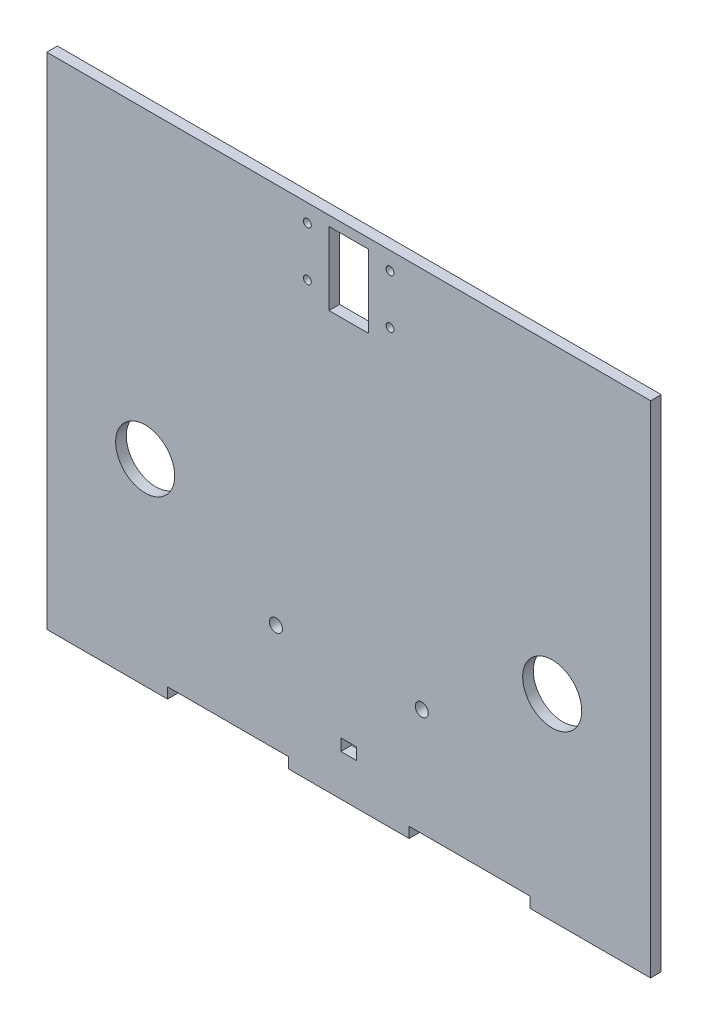
ISO-10303-21;
HEADER;
FILE_DESCRIPTION(('STEP AP214'),'2;1');
FILE_NAME('part.step','',(''),(''),'','','');
FILE_SCHEMA(('AUTOMOTIVE_DESIGN { 1 0 10303 214 1 1 1 1 }'));
ENDSEC;
DATA;
#1=APPLICATION_CONTEXT('core data for automotive mechanical design processes');
#2=APPLICATION_PROTOCOL_DEFINITION('international standard','automotive_design',2000,#1);
#3=PRODUCT_CONTEXT('',#1,'mechanical');
#4=PRODUCT('Part','Part','',(#3));
#5=PRODUCT_RELATED_PRODUCT_CATEGORY('part','',(#4));
#6=PRODUCT_DEFINITION_FORMATION('','',#4);
#7=PRODUCT_DEFINITION_CONTEXT('part definition',#1,'design');
#8=PRODUCT_DEFINITION('design','',#6,#7);
#9=PRODUCT_DEFINITION_SHAPE('','',#8);
#10=(LENGTH_UNIT() NAMED_UNIT(*) SI_UNIT(.MILLI.,.METRE.));
#11=(NAMED_UNIT(*) PLANE_ANGLE_UNIT() SI_UNIT($,.RADIAN.));
#12=(NAMED_UNIT(*) SI_UNIT($,.STERADIAN.) SOLID_ANGLE_UNIT());
#13=UNCERTAINTY_MEASURE_WITH_UNIT(LENGTH_MEASURE(1.E-05),#10,'distance_accuracy_value','');
#14=(GEOMETRIC_REPRESENTATION_CONTEXT(3) GLOBAL_UNCERTAINTY_ASSIGNED_CONTEXT((#13)) GLOBAL_UNIT_ASSIGNED_CONTEXT((#10,
#11,#12)) REPRESENTATION_CONTEXT('',''));
#15=CARTESIAN_POINT('',(0.,0.,0.));
#16=DIRECTION('',(0.,0.,1.));
#17=DIRECTION('',(1.,0.,0.));
#18=AXIS2_PLACEMENT_3D('',#15,#16,#17);
#19=CARTESIAN_POINT('',(0.,0.,2.7));
#20=DIRECTION('',(0.,0.,-1.));
#21=DIRECTION('',(-1.,0.,0.));
#22=AXIS2_PLACEMENT_3D('',#19,#20,#21);
#23=PLANE('',#22);
#24=CARTESIAN_POINT('',(51.7,22.,2.7));
#25=DIRECTION('',(0.,0.,1.));
#26=DIRECTION('',(-1.,0.,0.));
#27=AXIS2_PLACEMENT_3D('',#24,#25,#26);
#28=CIRCLE('',#27,7.5);
#29=CARTESIAN_POINT('',(44.2,22.,2.7));
#30=VERTEX_POINT('',#29);
#31=EDGE_CURVE('E209',#30,#30,#28,.T.);
#32=ORIENTED_EDGE('',*,*,#31,.F.);
#33=EDGE_LOOP('',(#32));
#34=FACE_BOUND('',#33,.T.);
#35=DIRECTION('',(1.,0.,0.));
#36=VECTOR('',#35,1.);
#37=CARTESIAN_POINT('',(2.,-17.5,2.7));
#38=LINE('',#37,#36);
#39=CARTESIAN_POINT('',(-2.,-17.5,2.7));
#40=VERTEX_POINT('',#39);
#41=CARTESIAN_POINT('',(2.,-17.5,2.7));
#42=VERTEX_POINT('',#41);
#43=EDGE_CURVE('E215',#40,#42,#38,.T.);
#44=ORIENTED_EDGE('',*,*,#43,.F.);
#45=DIRECTION('',(0.,-1.,0.));
#46=VECTOR('',#45,1.);
#47=CARTESIAN_POINT('',(-2.,-17.5,2.7));
#48=LINE('',#47,#46);
#49=CARTESIAN_POINT('',(-2.,-14.5,2.7));
#50=VERTEX_POINT('',#49);
#51=EDGE_CURVE('E223',#50,#40,#48,.T.);
#52=ORIENTED_EDGE('',*,*,#51,.F.);
#53=DIRECTION('',(-1.,0.,0.));
#54=VECTOR('',#53,1.);
#55=CARTESIAN_POINT('',(-2.,-14.5,2.7));
#56=LINE('',#55,#54);
#57=CARTESIAN_POINT('',(2.,-14.5,2.7));
#58=VERTEX_POINT('',#57);
#59=EDGE_CURVE('E220',#58,#50,#56,.T.);
#60=ORIENTED_EDGE('',*,*,#59,.F.);
#61=DIRECTION('',(0.,1.,0.));
#62=VECTOR('',#61,1.);
#63=CARTESIAN_POINT('',(2.,-14.5,2.7));
#64=LINE('',#63,#62);
#65=EDGE_CURVE('E217',#42,#58,#64,.T.);
#66=ORIENTED_EDGE('',*,*,#65,.F.);
#67=EDGE_LOOP('',(#44,#52,#60,#66));
#68=FACE_BOUND('',#67,.T.);
#69=DIRECTION('',(1.,0.,0.));
#70=VECTOR('',#69,1.);
#71=CARTESIAN_POINT('',(-15.34,-25.3,2.7));
#72=LINE('',#71,#70);
#73=CARTESIAN_POINT('',(-46.02,-25.3,2.7));
#74=VERTEX_POINT('',#73);
#75=CARTESIAN_POINT('',(-15.34,-25.3,2.7));
#76=VERTEX_POINT('',#75);
#77=EDGE_CURVE('E264',#74,#76,#72,.T.);
#78=ORIENTED_EDGE('',*,*,#77,.T.);
#79=DIRECTION('',(0.,-1.,0.));
#80=VECTOR('',#79,1.);
#81=CARTESIAN_POINT('',(-15.34,-28.,2.7));
#82=LINE('',#81,#80);
#83=CARTESIAN_POINT('',(-15.34,-28.,2.7));
#84=VERTEX_POINT('',#83);
#85=EDGE_CURVE('E267',#76,#84,#82,.T.);
#86=ORIENTED_EDGE('',*,*,#85,.T.);
#87=DIRECTION('',(1.,0.,0.));
#88=VECTOR('',#87,1.);
#89=CARTESIAN_POINT('',(-15.34,-28.,2.7));
#90=LINE('',#89,#88);
#91=CARTESIAN_POINT('',(15.34,-28.,2.7));
#92=VERTEX_POINT('',#91);
#93=EDGE_CURVE('E270',#84,#92,#90,.T.);
#94=ORIENTED_EDGE('',*,*,#93,.T.);
#95=DIRECTION('',(0.,1.,0.));
#96=VECTOR('',#95,1.);
#97=CARTESIAN_POINT('',(15.34,-28.,2.7));
#98=LINE('',#97,#96);
#99=CARTESIAN_POINT('',(15.34,-25.3,2.7));
#100=VERTEX_POINT('',#99);
#101=EDGE_CURVE('E272',#92,#100,#98,.T.);
#102=ORIENTED_EDGE('',*,*,#101,.T.);
#103=DIRECTION('',(1.,0.,0.));
#104=VECTOR('',#103,1.);
#105=CARTESIAN_POINT('',(15.34,-25.3,2.7));
#106=LINE('',#105,#104);
#107=CARTESIAN_POINT('',(46.02,-25.3,2.7));
#108=VERTEX_POINT('',#107);
#109=EDGE_CURVE('E274',#100,#108,#106,.T.);
#110=ORIENTED_EDGE('',*,*,#109,.T.);
#111=DIRECTION('',(0.,-1.,0.));
#112=VECTOR('',#111,1.);
#113=CARTESIAN_POINT('',(46.02,-28.,2.7));
#114=LINE('',#113,#112);
#115=CARTESIAN_POINT('',(46.02,-28.,2.7));
#116=VERTEX_POINT('',#115);
#117=EDGE_CURVE('E276',#108,#116,#114,.T.);
#118=ORIENTED_EDGE('',*,*,#117,.T.);
#119=DIRECTION('',(1.,0.,0.));
#120=VECTOR('',#119,1.);
#121=CARTESIAN_POINT('',(46.02,-28.,2.7));
#122=LINE('',#121,#120);
#123=CARTESIAN_POINT('',(76.7,-28.,2.7));
#124=VERTEX_POINT('',#123);
#125=EDGE_CURVE('E278',#116,#124,#122,.T.);
#126=ORIENTED_EDGE('',*,*,#125,.T.);
#127=DIRECTION('',(0.,1.,0.));
#128=VECTOR('',#127,1.);
#129=CARTESIAN_POINT('',(76.7,-28.,2.7));
#130=LINE('',#129,#128);
#131=CARTESIAN_POINT('',(76.7,99.,2.7));
#132=VERTEX_POINT('',#131);
#133=EDGE_CURVE('E280',#124,#132,#130,.T.);
#134=ORIENTED_EDGE('',*,*,#133,.T.);
#135=DIRECTION('',(-1.,0.,0.));
#136=VECTOR('',#135,1.);
#137=CARTESIAN_POINT('',(76.7,99.,2.7));
#138=LINE('',#137,#136);
#139=CARTESIAN_POINT('',(-76.7,99.,2.7));
#140=VERTEX_POINT('',#139);
#141=EDGE_CURVE('E282',#132,#140,#138,.T.);
#142=ORIENTED_EDGE('',*,*,#141,.T.);
#143=DIRECTION('',(0.,-1.,0.));
#144=VECTOR('',#143,1.);
#145=CARTESIAN_POINT('',(-76.7,-28.,2.7));
#146=LINE('',#145,#144);
#147=CARTESIAN_POINT('',(-76.7,-28.,2.7));
#148=VERTEX_POINT('',#147);
#149=EDGE_CURVE('E284',#140,#148,#146,.T.);
#150=ORIENTED_EDGE('',*,*,#149,.T.);
#151=DIRECTION('',(1.,0.,0.));
#152=VECTOR('',#151,1.);
#153=CARTESIAN_POINT('',(-46.02,-28.,2.7));
#154=LINE('',#153,#152);
#155=CARTESIAN_POINT('',(-46.02,-28.,2.7));
#156=VERTEX_POINT('',#155);
#157=EDGE_CURVE('E286',#148,#156,#154,.T.);
#158=ORIENTED_EDGE('',*,*,#157,.T.);
#159=DIRECTION('',(0.,1.,0.));
#160=VECTOR('',#159,1.);
#161=CARTESIAN_POINT('',(-46.02,-28.,2.7));
#162=LINE('',#161,#160);
#163=EDGE_CURVE('E288',#156,#74,#162,.T.);
#164=ORIENTED_EDGE('',*,*,#163,.T.);
#165=EDGE_LOOP('',(#78,#86,#94,#102,#110,#118,#126,#134,#142,#150,#158,#164));
#166=FACE_BOUND('',#165,.T.);
#167=CARTESIAN_POINT('',(-51.7,22.,2.7));
#168=DIRECTION('',(0.,0.,1.));
#169=DIRECTION('',(1.,0.,0.));
#170=AXIS2_PLACEMENT_3D('',#167,#168,#169);
#171=CIRCLE('',#170,7.5);
#172=CARTESIAN_POINT('',(-44.2,22.,2.7));
#173=VERTEX_POINT('',#172);
#174=EDGE_CURVE('E258',#173,#173,#171,.T.);
#175=ORIENTED_EDGE('',*,*,#174,.F.);
#176=EDGE_LOOP('',(#175));
#177=FACE_BOUND('',#176,.T.);
#178=CARTESIAN_POINT('',(-18.5,1.99999999999998,2.7));
#179=DIRECTION('',(0.,0.,1.));
#180=DIRECTION('',(1.,0.,0.));
#181=AXIS2_PLACEMENT_3D('',#178,#179,#180);
#182=CIRCLE('',#181,1.65);
#183=CARTESIAN_POINT('',(-16.85,1.99999999999998,2.7));
#184=VERTEX_POINT('',#183);
#185=EDGE_CURVE('E252',#184,#184,#182,.T.);
#186=ORIENTED_EDGE('',*,*,#185,.F.);
#187=EDGE_LOOP('',(#186));
#188=FACE_BOUND('',#187,.T.);
#189=CARTESIAN_POINT('',(18.5679402330637,1.99999999999998,2.7));
#190=DIRECTION('',(0.,0.,1.));
#191=DIRECTION('',(1.,0.,0.));
#192=AXIS2_PLACEMENT_3D('',#189,#190,#191);
#193=CIRCLE('',#192,1.65);
#194=CARTESIAN_POINT('',(20.2179402330637,1.99999999999998,2.7));
#195=VERTEX_POINT('',#194);
#196=EDGE_CURVE('E246',#195,#195,#193,.T.);
#197=ORIENTED_EDGE('',*,*,#196,.F.);
#198=EDGE_LOOP('',(#197));
#199=FACE_BOUND('',#198,.T.);
#200=DIRECTION('',(0.,-1.,0.));
#201=VECTOR('',#200,1.);
#202=CARTESIAN_POINT('',(-5.,78.,2.7));
#203=LINE('',#202,#201);
#204=CARTESIAN_POINT('',(-5.,96.5,2.7));
#205=VERTEX_POINT('',#204);
#206=CARTESIAN_POINT('',(-5.,78.,2.7));
#207=VERTEX_POINT('',#206);
#208=EDGE_CURVE('E170',#205,#207,#203,.T.);
#209=ORIENTED_EDGE('',*,*,#208,.F.);
#210=DIRECTION('',(-1.,0.,0.));
#211=VECTOR('',#210,1.);
#212=CARTESIAN_POINT('',(5.,96.5,2.7));
#213=LINE('',#212,#211);
#214=CARTESIAN_POINT('',(5.,96.5,2.7));
#215=VERTEX_POINT('',#214);
#216=EDGE_CURVE('E193',#215,#205,#213,.T.);
#217=ORIENTED_EDGE('',*,*,#216,.F.);
#218=DIRECTION('',(0.,1.,0.));
#219=VECTOR('',#218,1.);
#220=CARTESIAN_POINT('',(5.,78.,2.7));
#221=LINE('',#220,#219);
#222=CARTESIAN_POINT('',(5.,78.,2.7));
#223=VERTEX_POINT('',#222);
#224=EDGE_CURVE('E191',#223,#215,#221,.T.);
#225=ORIENTED_EDGE('',*,*,#224,.F.);
#226=DIRECTION('',(1.,0.,0.));
#227=VECTOR('',#226,1.);
#228=CARTESIAN_POINT('',(5.,78.,2.7));
#229=LINE('',#228,#227);
#230=EDGE_CURVE('E178',#207,#223,#229,.T.);
#231=ORIENTED_EDGE('',*,*,#230,.F.);
#232=EDGE_LOOP('',(#209,#217,#225,#231));
#233=FACE_BOUND('',#232,.T.);
#234=CARTESIAN_POINT('',(-10.5,94.5,2.7));
#235=DIRECTION('',(0.,0.,1.));
#236=DIRECTION('',(1.,0.,0.));
#237=AXIS2_PLACEMENT_3D('',#234,#235,#236);
#238=CIRCLE('',#237,0.999999999999998);
#239=CARTESIAN_POINT('',(-9.50000000000001,94.5,2.7));
#240=VERTEX_POINT('',#239);
#241=EDGE_CURVE('E199',#240,#240,#238,.T.);
#242=ORIENTED_EDGE('',*,*,#241,.F.);
#243=EDGE_LOOP('',(#242));
#244=FACE_BOUND('',#243,.T.);
#245=CARTESIAN_POINT('',(-10.5,82.,2.7));
#246=DIRECTION('',(0.,0.,1.));
#247=DIRECTION('',(1.,0.,0.));
#248=AXIS2_PLACEMENT_3D('',#245,#246,#247);
#249=CIRCLE('',#248,0.999999999999998);
#250=CARTESIAN_POINT('',(-9.50000000000001,82.,2.7));
#251=VERTEX_POINT('',#250);
#252=EDGE_CURVE('E692',#251,#251,#249,.T.);
#253=ORIENTED_EDGE('',*,*,#252,.F.);
#254=EDGE_LOOP('',(#253));
#255=FACE_BOUND('',#254,.T.);
#256=CARTESIAN_POINT('',(10.5,94.5,2.7));
#257=DIRECTION('',(0.,0.,1.));
#258=DIRECTION('',(1.,0.,0.));
#259=AXIS2_PLACEMENT_3D('',#256,#257,#258);
#260=CIRCLE('',#259,0.999999999999998);
#261=CARTESIAN_POINT('',(11.5,94.5,2.7));
#262=VERTEX_POINT('',#261);
#263=EDGE_CURVE('E686',#262,#262,#260,.T.);
#264=ORIENTED_EDGE('',*,*,#263,.F.);
#265=EDGE_LOOP('',(#264));
#266=FACE_BOUND('',#265,.T.);
#267=CARTESIAN_POINT('',(10.5,82.,2.7));
#268=DIRECTION('',(0.,0.,1.));
#269=DIRECTION('',(1.,0.,0.));
#270=AXIS2_PLACEMENT_3D('',#267,#268,#269);
#271=CIRCLE('',#270,0.999999999999998);
#272=CARTESIAN_POINT('',(11.5,82.,2.7));
#273=VERTEX_POINT('',#272);
#274=EDGE_CURVE('E677',#273,#273,#271,.T.);
#275=ORIENTED_EDGE('',*,*,#274,.F.);
#276=EDGE_LOOP('',(#275));
#277=FACE_BOUND('',#276,.T.);
#278=ADVANCED_FACE('F33',(#34,#68,#166,#177,#188,#199,#233,#244,#255,#266,#277),#23,.F.);
#279=CARTESIAN_POINT('',(0.,0.,0.));
#280=DIRECTION('',(0.,0.,-1.));
#281=DIRECTION('',(-1.,0.,0.));
#282=AXIS2_PLACEMENT_3D('',#279,#280,#281);
#283=PLANE('',#282);
#284=CARTESIAN_POINT('',(10.5,94.5,0.));
#285=DIRECTION('',(0.,0.,1.));
#286=DIRECTION('',(1.,0.,0.));
#287=AXIS2_PLACEMENT_3D('',#284,#285,#286);
#288=CIRCLE('',#287,0.999999999999998);
#289=CARTESIAN_POINT('',(11.5,94.5,0.));
#290=VERTEX_POINT('',#289);
#291=EDGE_CURVE('E683',#290,#290,#288,.T.);
#292=ORIENTED_EDGE('',*,*,#291,.T.);
#293=EDGE_LOOP('',(#292));
#294=FACE_BOUND('',#293,.T.);
#295=CARTESIAN_POINT('',(-10.5,94.5,0.));
#296=DIRECTION('',(0.,0.,1.));
#297=DIRECTION('',(1.,0.,0.));
#298=AXIS2_PLACEMENT_3D('',#295,#296,#297);
#299=CIRCLE('',#298,0.999999999999998);
#300=CARTESIAN_POINT('',(-9.50000000000001,94.5,0.));
#301=VERTEX_POINT('',#300);
#302=EDGE_CURVE('E695',#301,#301,#299,.T.);
#303=ORIENTED_EDGE('',*,*,#302,.T.);
#304=EDGE_LOOP('',(#303));
#305=FACE_BOUND('',#304,.T.);
#306=DIRECTION('',(0.,-1.,0.));
#307=VECTOR('',#306,1.);
#308=CARTESIAN_POINT('',(-2.,-17.5,0.));
#309=LINE('',#308,#307);
#310=CARTESIAN_POINT('',(-2.,-14.5,0.));
#311=VERTEX_POINT('',#310);
#312=CARTESIAN_POINT('',(-2.,-17.5,0.));
#313=VERTEX_POINT('',#312);
#314=EDGE_CURVE('E218',#311,#313,#309,.T.);
#315=ORIENTED_EDGE('',*,*,#314,.T.);
#316=DIRECTION('',(1.,0.,0.));
#317=VECTOR('',#316,1.);
#318=CARTESIAN_POINT('',(2.,-17.5,0.));
#319=LINE('',#318,#317);
#320=CARTESIAN_POINT('',(2.,-17.5,0.));
#321=VERTEX_POINT('',#320);
#322=EDGE_CURVE('E212',#313,#321,#319,.T.);
#323=ORIENTED_EDGE('',*,*,#322,.T.);
#324=DIRECTION('',(0.,1.,0.));
#325=VECTOR('',#324,1.);
#326=CARTESIAN_POINT('',(2.,-14.5,0.));
#327=LINE('',#326,#325);
#328=CARTESIAN_POINT('',(2.,-14.5,0.));
#329=VERTEX_POINT('',#328);
#330=EDGE_CURVE('E228',#321,#329,#327,.T.);
#331=ORIENTED_EDGE('',*,*,#330,.T.);
#332=DIRECTION('',(-1.,0.,0.));
#333=VECTOR('',#332,1.);
#334=CARTESIAN_POINT('',(-2.,-14.5,0.));
#335=LINE('',#334,#333);
#336=EDGE_CURVE('E231',#329,#311,#335,.T.);
#337=ORIENTED_EDGE('',*,*,#336,.T.);
#338=EDGE_LOOP('',(#315,#323,#331,#337));
#339=FACE_BOUND('',#338,.T.);
#340=CARTESIAN_POINT('',(18.5679402330637,1.99999999999998,0.));
#341=DIRECTION('',(0.,0.,1.));
#342=DIRECTION('',(1.,0.,0.));
#343=AXIS2_PLACEMENT_3D('',#340,#341,#342);
#344=CIRCLE('',#343,1.65);
#345=CARTESIAN_POINT('',(20.2179402330637,1.99999999999998,0.));
#346=VERTEX_POINT('',#345);
#347=EDGE_CURVE('E245',#346,#346,#344,.T.);
#348=ORIENTED_EDGE('',*,*,#347,.T.);
#349=EDGE_LOOP('',(#348));
#350=FACE_BOUND('',#349,.T.);
#351=CARTESIAN_POINT('',(-51.7,22.,0.));
#352=DIRECTION('',(0.,0.,1.));
#353=DIRECTION('',(1.,0.,0.));
#354=AXIS2_PLACEMENT_3D('',#351,#352,#353);
#355=CIRCLE('',#354,7.5);
#356=CARTESIAN_POINT('',(-44.2,22.,0.));
#357=VERTEX_POINT('',#356);
#358=EDGE_CURVE('E255',#357,#357,#355,.T.);
#359=ORIENTED_EDGE('',*,*,#358,.T.);
#360=EDGE_LOOP('',(#359));
#361=FACE_BOUND('',#360,.T.);
#362=DIRECTION('',(1.,0.,0.));
#363=VECTOR('',#362,1.);
#364=CARTESIAN_POINT('',(-15.34,-25.3,0.));
#365=LINE('',#364,#363);
#366=CARTESIAN_POINT('',(-46.02,-25.3,0.));
#367=VERTEX_POINT('',#366);
#368=CARTESIAN_POINT('',(-15.34,-25.3,0.));
#369=VERTEX_POINT('',#368);
#370=EDGE_CURVE('E261',#367,#369,#365,.T.);
#371=ORIENTED_EDGE('',*,*,#370,.F.);
#372=DIRECTION('',(0.,1.,0.));
#373=VECTOR('',#372,1.);
#374=CARTESIAN_POINT('',(-46.02,-28.,0.));
#375=LINE('',#374,#373);
#376=CARTESIAN_POINT('',(-46.02,-28.,0.));
#377=VERTEX_POINT('',#376);
#378=EDGE_CURVE('E268',#377,#367,#375,.T.);
#379=ORIENTED_EDGE('',*,*,#378,.F.);
#380=DIRECTION('',(1.,0.,0.));
#381=VECTOR('',#380,1.);
#382=CARTESIAN_POINT('',(-46.02,-28.,0.));
#383=LINE('',#382,#381);
#384=CARTESIAN_POINT('',(-76.7,-28.,0.));
#385=VERTEX_POINT('',#384);
#386=EDGE_CURVE('E311',#385,#377,#383,.T.);
#387=ORIENTED_EDGE('',*,*,#386,.F.);
#388=DIRECTION('',(0.,-1.,0.));
#389=VECTOR('',#388,1.);
#390=CARTESIAN_POINT('',(-76.7,-28.,0.));
#391=LINE('',#390,#389);
#392=CARTESIAN_POINT('',(-76.7,99.,0.));
#393=VERTEX_POINT('',#392);
#394=EDGE_CURVE('E309',#393,#385,#391,.T.);
#395=ORIENTED_EDGE('',*,*,#394,.F.);
#396=DIRECTION('',(-1.,0.,0.));
#397=VECTOR('',#396,1.);
#398=CARTESIAN_POINT('',(76.7,99.,0.));
#399=LINE('',#398,#397);
#400=CARTESIAN_POINT('',(76.7,99.,0.));
#401=VERTEX_POINT('',#400);
#402=EDGE_CURVE('E307',#401,#393,#399,.T.);
#403=ORIENTED_EDGE('',*,*,#402,.F.);
#404=DIRECTION('',(0.,1.,0.));
#405=VECTOR('',#404,1.);
#406=CARTESIAN_POINT('',(76.7,-28.,0.));
#407=LINE('',#406,#405);
#408=CARTESIAN_POINT('',(76.7,-28.,0.));
#409=VERTEX_POINT('',#408);
#410=EDGE_CURVE('E305',#409,#401,#407,.T.);
#411=ORIENTED_EDGE('',*,*,#410,.F.);
#412=DIRECTION('',(1.,0.,0.));
#413=VECTOR('',#412,1.);
#414=CARTESIAN_POINT('',(46.02,-28.,0.));
#415=LINE('',#414,#413);
#416=CARTESIAN_POINT('',(46.02,-28.,0.));
#417=VERTEX_POINT('',#416);
#418=EDGE_CURVE('E303',#417,#409,#415,.T.);
#419=ORIENTED_EDGE('',*,*,#418,.F.);
#420=DIRECTION('',(0.,-1.,0.));
#421=VECTOR('',#420,1.);
#422=CARTESIAN_POINT('',(46.02,-28.,0.));
#423=LINE('',#422,#421);
#424=CARTESIAN_POINT('',(46.02,-25.3,0.));
#425=VERTEX_POINT('',#424);
#426=EDGE_CURVE('E301',#425,#417,#423,.T.);
#427=ORIENTED_EDGE('',*,*,#426,.F.);
#428=DIRECTION('',(1.,0.,0.));
#429=VECTOR('',#428,1.);
#430=CARTESIAN_POINT('',(15.34,-25.3,0.));
#431=LINE('',#430,#429);
#432=CARTESIAN_POINT('',(15.34,-25.3,0.));
#433=VERTEX_POINT('',#432);
#434=EDGE_CURVE('E299',#433,#425,#431,.T.);
#435=ORIENTED_EDGE('',*,*,#434,.F.);
#436=DIRECTION('',(0.,1.,0.));
#437=VECTOR('',#436,1.);
#438=CARTESIAN_POINT('',(15.34,-28.,0.));
#439=LINE('',#438,#437);
#440=CARTESIAN_POINT('',(15.34,-28.,0.));
#441=VERTEX_POINT('',#440);
#442=EDGE_CURVE('E297',#441,#433,#439,.T.);
#443=ORIENTED_EDGE('',*,*,#442,.F.);
#444=DIRECTION('',(1.,0.,0.));
#445=VECTOR('',#444,1.);
#446=CARTESIAN_POINT('',(-15.34,-28.,0.));
#447=LINE('',#446,#445);
#448=CARTESIAN_POINT('',(-15.34,-28.,0.));
#449=VERTEX_POINT('',#448);
#450=EDGE_CURVE('E295',#449,#441,#447,.T.);
#451=ORIENTED_EDGE('',*,*,#450,.F.);
#452=DIRECTION('',(0.,-1.,0.));
#453=VECTOR('',#452,1.);
#454=CARTESIAN_POINT('',(-15.34,-28.,0.));
#455=LINE('',#454,#453);
#456=EDGE_CURVE('E293',#369,#449,#455,.T.);
#457=ORIENTED_EDGE('',*,*,#456,.F.);
#458=EDGE_LOOP('',(#371,#379,#387,#395,#403,#411,#419,#427,#435,#443,#451,#457));
#459=FACE_BOUND('',#458,.T.);
#460=CARTESIAN_POINT('',(-18.5,1.99999999999998,0.));
#461=DIRECTION('',(0.,0.,1.));
#462=DIRECTION('',(1.,0.,0.));
#463=AXIS2_PLACEMENT_3D('',#460,#461,#462);
#464=CIRCLE('',#463,1.65);
#465=CARTESIAN_POINT('',(-16.85,1.99999999999998,0.));
#466=VERTEX_POINT('',#465);
#467=EDGE_CURVE('E249',#466,#466,#464,.T.);
#468=ORIENTED_EDGE('',*,*,#467,.T.);
#469=EDGE_LOOP('',(#468));
#470=FACE_BOUND('',#469,.T.);
#471=CARTESIAN_POINT('',(51.7,22.,0.));
#472=DIRECTION('',(0.,0.,1.));
#473=DIRECTION('',(-1.,0.,0.));
#474=AXIS2_PLACEMENT_3D('',#471,#472,#473);
#475=CIRCLE('',#474,7.5);
#476=CARTESIAN_POINT('',(44.2,22.,0.));
#477=VERTEX_POINT('',#476);
#478=EDGE_CURVE('E186',#477,#477,#475,.T.);
#479=ORIENTED_EDGE('',*,*,#478,.T.);
#480=EDGE_LOOP('',(#479));
#481=FACE_BOUND('',#480,.T.);
#482=DIRECTION('',(-1.,0.,0.));
#483=VECTOR('',#482,1.);
#484=CARTESIAN_POINT('',(5.,96.5,0.));
#485=LINE('',#484,#483);
#486=CARTESIAN_POINT('',(5.,96.5,0.));
#487=VERTEX_POINT('',#486);
#488=CARTESIAN_POINT('',(-5.,96.5,0.));
#489=VERTEX_POINT('',#488);
#490=EDGE_CURVE('E179',#487,#489,#485,.T.);
#491=ORIENTED_EDGE('',*,*,#490,.T.);
#492=DIRECTION('',(0.,-1.,0.));
#493=VECTOR('',#492,1.);
#494=CARTESIAN_POINT('',(-5.,78.,0.));
#495=LINE('',#494,#493);
#496=CARTESIAN_POINT('',(-5.,78.,0.));
#497=VERTEX_POINT('',#496);
#498=EDGE_CURVE('E56',#489,#497,#495,.T.);
#499=ORIENTED_EDGE('',*,*,#498,.T.);
#500=DIRECTION('',(1.,0.,0.));
#501=VECTOR('',#500,1.);
#502=CARTESIAN_POINT('',(5.,78.,0.));
#503=LINE('',#502,#501);
#504=CARTESIAN_POINT('',(5.,78.,0.));
#505=VERTEX_POINT('',#504);
#506=EDGE_CURVE('E185',#497,#505,#503,.T.);
#507=ORIENTED_EDGE('',*,*,#506,.T.);
#508=DIRECTION('',(0.,1.,0.));
#509=VECTOR('',#508,1.);
#510=CARTESIAN_POINT('',(5.,78.,0.));
#511=LINE('',#510,#509);
#512=EDGE_CURVE('E201',#505,#487,#511,.T.);
#513=ORIENTED_EDGE('',*,*,#512,.T.);
#514=EDGE_LOOP('',(#491,#499,#507,#513));
#515=FACE_BOUND('',#514,.T.);
#516=CARTESIAN_POINT('',(-10.5,82.,0.));
#517=DIRECTION('',(0.,0.,1.));
#518=DIRECTION('',(1.,0.,0.));
#519=AXIS2_PLACEMENT_3D('',#516,#517,#518);
#520=CIRCLE('',#519,0.999999999999998);
#521=CARTESIAN_POINT('',(-9.50000000000001,82.,0.));
#522=VERTEX_POINT('',#521);
#523=EDGE_CURVE('E689',#522,#522,#520,.T.);
#524=ORIENTED_EDGE('',*,*,#523,.T.);
#525=EDGE_LOOP('',(#524));
#526=FACE_BOUND('',#525,.T.);
#527=CARTESIAN_POINT('',(10.5,82.,0.));
#528=DIRECTION('',(0.,0.,1.));
#529=DIRECTION('',(1.,0.,0.));
#530=AXIS2_PLACEMENT_3D('',#527,#528,#529);
#531=CIRCLE('',#530,0.999999999999998);
#532=CARTESIAN_POINT('',(11.5,82.,0.));
#533=VERTEX_POINT('',#532);
#534=EDGE_CURVE('E680',#533,#533,#531,.T.);
#535=ORIENTED_EDGE('',*,*,#534,.T.);
#536=EDGE_LOOP('',(#535));
#537=FACE_BOUND('',#536,.T.);
#538=ADVANCED_FACE('F353',(#294,#305,#339,#350,#361,#459,#470,#481,#515,#526,#537),#283,.T.);
#539=CARTESIAN_POINT('',(-15.34,-25.3,2.7));
#540=DIRECTION('',(0.,1.,0.));
#541=DIRECTION('',(0.,0.,1.));
#542=AXIS2_PLACEMENT_3D('',#539,#540,#541);
#543=PLANE('',#542);
#544=ORIENTED_EDGE('',*,*,#370,.T.);
#545=DIRECTION('',(0.,0.,-1.));
#546=VECTOR('',#545,1.);
#547=CARTESIAN_POINT('',(-15.34,-25.3,2.7));
#548=LINE('',#547,#546);
#549=EDGE_CURVE('E11',#76,#369,#548,.T.);
#550=ORIENTED_EDGE('',*,*,#549,.F.);
#551=ORIENTED_EDGE('',*,*,#77,.F.);
#552=DIRECTION('',(0.,0.,-1.));
#553=VECTOR('',#552,1.);
#554=CARTESIAN_POINT('',(-46.02,-25.3,2.7));
#555=LINE('',#554,#553);
#556=EDGE_CURVE('E290',#74,#367,#555,.T.);
#557=ORIENTED_EDGE('',*,*,#556,.T.);
#558=EDGE_LOOP('',(#544,#550,#551,#557));
#559=FACE_BOUND('',#558,.T.);
#560=ADVANCED_FACE('F35',(#559),#543,.F.);
#561=CARTESIAN_POINT('',(-15.34,-28.,2.7));
#562=DIRECTION('',(1.,0.,0.));
#563=DIRECTION('',(0.,1.,0.));
#564=AXIS2_PLACEMENT_3D('',#561,#562,#563);
#565=PLANE('',#564);
#566=ORIENTED_EDGE('',*,*,#456,.T.);
#567=DIRECTION('',(0.,0.,-1.));
#568=VECTOR('',#567,1.);
#569=CARTESIAN_POINT('',(-15.34,-28.,2.7));
#570=LINE('',#569,#568);
#571=EDGE_CURVE('E41',#84,#449,#570,.T.);
#572=ORIENTED_EDGE('',*,*,#571,.F.);
#573=ORIENTED_EDGE('',*,*,#85,.F.);
#574=ORIENTED_EDGE('',*,*,#549,.T.);
#575=EDGE_LOOP('',(#566,#572,#573,#574));
#576=FACE_BOUND('',#575,.T.);
#577=ADVANCED_FACE('F371',(#576),#565,.F.);
#578=CARTESIAN_POINT('',(-15.34,-28.,2.7));
#579=DIRECTION('',(0.,1.,0.));
#580=DIRECTION('',(-1.,0.,0.));
#581=AXIS2_PLACEMENT_3D('',#578,#579,#580);
#582=PLANE('',#581);
#583=ORIENTED_EDGE('',*,*,#450,.T.);
#584=DIRECTION('',(0.,0.,-1.));
#585=VECTOR('',#584,1.);
#586=CARTESIAN_POINT('',(15.34,-28.,2.7));
#587=LINE('',#586,#585);
#588=EDGE_CURVE('E340',#92,#441,#587,.T.);
#589=ORIENTED_EDGE('',*,*,#588,.F.);
#590=ORIENTED_EDGE('',*,*,#93,.F.);
#591=ORIENTED_EDGE('',*,*,#571,.T.);
#592=EDGE_LOOP('',(#583,#589,#590,#591));
#593=FACE_BOUND('',#592,.T.);
#594=ADVANCED_FACE('F347',(#593),#582,.F.);
#595=CARTESIAN_POINT('',(15.34,-28.,2.7));
#596=DIRECTION('',(-1.,0.,0.));
#597=DIRECTION('',(0.,-1.,0.));
#598=AXIS2_PLACEMENT_3D('',#595,#596,#597);
#599=PLANE('',#598);
#600=ORIENTED_EDGE('',*,*,#442,.T.);
#601=DIRECTION('',(0.,0.,-1.));
#602=VECTOR('',#601,1.);
#603=CARTESIAN_POINT('',(15.34,-25.3,2.7));
#604=LINE('',#603,#602);
#605=EDGE_CURVE('E337',#100,#433,#604,.T.);
#606=ORIENTED_EDGE('',*,*,#605,.F.);
#607=ORIENTED_EDGE('',*,*,#101,.F.);
#608=ORIENTED_EDGE('',*,*,#588,.T.);
#609=EDGE_LOOP('',(#600,#606,#607,#608));
#610=FACE_BOUND('',#609,.T.);
#611=ADVANCED_FACE('F359',(#610),#599,.F.);
#612=CARTESIAN_POINT('',(15.34,-25.3,2.7));
#613=DIRECTION('',(0.,1.,0.));
#614=DIRECTION('',(0.,0.,1.));
#615=AXIS2_PLACEMENT_3D('',#612,#613,#614);
#616=PLANE('',#615);
#617=ORIENTED_EDGE('',*,*,#434,.T.);
#618=DIRECTION('',(0.,0.,-1.));
#619=VECTOR('',#618,1.);
#620=CARTESIAN_POINT('',(46.02,-25.3,2.7));
#621=LINE('',#620,#619);
#622=EDGE_CURVE('E334',#108,#425,#621,.T.);
#623=ORIENTED_EDGE('',*,*,#622,.F.);
#624=ORIENTED_EDGE('',*,*,#109,.F.);
#625=ORIENTED_EDGE('',*,*,#605,.T.);
#626=EDGE_LOOP('',(#617,#623,#624,#625));
#627=FACE_BOUND('',#626,.T.);
#628=ADVANCED_FACE('F363',(#627),#616,.F.);
#629=CARTESIAN_POINT('',(46.02,-28.,2.7));
#630=DIRECTION('',(1.,0.,0.));
#631=DIRECTION('',(0.,0.,-1.));
#632=AXIS2_PLACEMENT_3D('',#629,#630,#631);
#633=PLANE('',#632);
#634=ORIENTED_EDGE('',*,*,#426,.T.);
#635=DIRECTION('',(0.,0.,-1.));
#636=VECTOR('',#635,1.);
#637=CARTESIAN_POINT('',(46.02,-28.,2.7));
#638=LINE('',#637,#636);
#639=EDGE_CURVE('E331',#116,#417,#638,.T.);
#640=ORIENTED_EDGE('',*,*,#639,.F.);
#641=ORIENTED_EDGE('',*,*,#117,.F.);
#642=ORIENTED_EDGE('',*,*,#622,.T.);
#643=EDGE_LOOP('',(#634,#640,#641,#642));
#644=FACE_BOUND('',#643,.T.);
#645=ADVANCED_FACE('F404',(#644),#633,.F.);
#646=CARTESIAN_POINT('',(46.02,-28.,2.7));
#647=DIRECTION('',(0.,1.,0.));
#648=DIRECTION('',(0.,0.,1.));
#649=AXIS2_PLACEMENT_3D('',#646,#647,#648);
#650=PLANE('',#649);
#651=ORIENTED_EDGE('',*,*,#418,.T.);
#652=DIRECTION('',(0.,0.,-1.));
#653=VECTOR('',#652,1.);
#654=CARTESIAN_POINT('',(76.7,-28.,2.7));
#655=LINE('',#654,#653);
#656=EDGE_CURVE('E328',#124,#409,#655,.T.);
#657=ORIENTED_EDGE('',*,*,#656,.F.);
#658=ORIENTED_EDGE('',*,*,#125,.F.);
#659=ORIENTED_EDGE('',*,*,#639,.T.);
#660=EDGE_LOOP('',(#651,#657,#658,#659));
#661=FACE_BOUND('',#660,.T.);
#662=ADVANCED_FACE('F402',(#661),#650,.F.);
#663=CARTESIAN_POINT('',(76.7,-28.,2.7));
#664=DIRECTION('',(-1.,0.,0.));
#665=DIRECTION('',(0.,-1.,0.));
#666=AXIS2_PLACEMENT_3D('',#663,#664,#665);
#667=PLANE('',#666);
#668=ORIENTED_EDGE('',*,*,#410,.T.);
#669=DIRECTION('',(0.,0.,-1.));
#670=VECTOR('',#669,1.);
#671=CARTESIAN_POINT('',(76.7,99.,2.7));
#672=LINE('',#671,#670);
#673=EDGE_CURVE('E325',#132,#401,#672,.T.);
#674=ORIENTED_EDGE('',*,*,#673,.F.);
#675=ORIENTED_EDGE('',*,*,#133,.F.);
#676=ORIENTED_EDGE('',*,*,#656,.T.);
#677=EDGE_LOOP('',(#668,#674,#675,#676));
#678=FACE_BOUND('',#677,.T.);
#679=ADVANCED_FACE('F398',(#678),#667,.F.);
#680=CARTESIAN_POINT('',(76.7,99.,2.7));
#681=DIRECTION('',(0.,-1.,0.));
#682=DIRECTION('',(0.,0.,-1.));
#683=AXIS2_PLACEMENT_3D('',#680,#681,#682);
#684=PLANE('',#683);
#685=ORIENTED_EDGE('',*,*,#402,.T.);
#686=DIRECTION('',(0.,0.,-1.));
#687=VECTOR('',#686,1.);
#688=CARTESIAN_POINT('',(-76.7,99.,2.7));
#689=LINE('',#688,#687);
#690=EDGE_CURVE('E322',#140,#393,#689,.T.);
#691=ORIENTED_EDGE('',*,*,#690,.F.);
#692=ORIENTED_EDGE('',*,*,#141,.F.);
#693=ORIENTED_EDGE('',*,*,#673,.T.);
#694=EDGE_LOOP('',(#685,#691,#692,#693));
#695=FACE_BOUND('',#694,.T.);
#696=ADVANCED_FACE('F393',(#695),#684,.F.);
#697=CARTESIAN_POINT('',(-76.7,-28.,2.7));
#698=DIRECTION('',(1.,0.,0.));
#699=DIRECTION('',(0.,0.,-1.));
#700=AXIS2_PLACEMENT_3D('',#697,#698,#699);
#701=PLANE('',#700);
#702=ORIENTED_EDGE('',*,*,#394,.T.);
#703=DIRECTION('',(0.,0.,-1.));
#704=VECTOR('',#703,1.);
#705=CARTESIAN_POINT('',(-76.7,-28.,2.7));
#706=LINE('',#705,#704);
#707=EDGE_CURVE('E319',#148,#385,#706,.T.);
#708=ORIENTED_EDGE('',*,*,#707,.F.);
#709=ORIENTED_EDGE('',*,*,#149,.F.);
#710=ORIENTED_EDGE('',*,*,#690,.T.);
#711=EDGE_LOOP('',(#702,#708,#709,#710));
#712=FACE_BOUND('',#711,.T.);
#713=ADVANCED_FACE('F387',(#712),#701,.F.);
#714=CARTESIAN_POINT('',(-46.02,-28.,2.7));
#715=DIRECTION('',(0.,1.,0.));
#716=DIRECTION('',(0.,0.,1.));
#717=AXIS2_PLACEMENT_3D('',#714,#715,#716);
#718=PLANE('',#717);
#719=ORIENTED_EDGE('',*,*,#386,.T.);
#720=DIRECTION('',(0.,0.,-1.));
#721=VECTOR('',#720,1.);
#722=CARTESIAN_POINT('',(-46.02,-28.,2.7));
#723=LINE('',#722,#721);
#724=EDGE_CURVE('E316',#156,#377,#723,.T.);
#725=ORIENTED_EDGE('',*,*,#724,.F.);
#726=ORIENTED_EDGE('',*,*,#157,.F.);
#727=ORIENTED_EDGE('',*,*,#707,.T.);
#728=EDGE_LOOP('',(#719,#725,#726,#727));
#729=FACE_BOUND('',#728,.T.);
#730=ADVANCED_FACE('F383',(#729),#718,.F.);
#731=CARTESIAN_POINT('',(-46.02,-28.,2.7));
#732=DIRECTION('',(-1.,0.,0.));
#733=DIRECTION('',(0.,0.,1.));
#734=AXIS2_PLACEMENT_3D('',#731,#732,#733);
#735=PLANE('',#734);
#736=ORIENTED_EDGE('',*,*,#378,.T.);
#737=ORIENTED_EDGE('',*,*,#556,.F.);
#738=ORIENTED_EDGE('',*,*,#163,.F.);
#739=ORIENTED_EDGE('',*,*,#724,.T.);
#740=EDGE_LOOP('',(#736,#737,#738,#739));
#741=FACE_BOUND('',#740,.T.);
#742=ADVANCED_FACE('F378',(#741),#735,.F.);
#743=CARTESIAN_POINT('',(-51.7,22.,2.7));
#744=DIRECTION('',(0.,0.,-1.));
#745=DIRECTION('',(-1.,0.,0.));
#746=AXIS2_PLACEMENT_3D('',#743,#744,#745);
#747=CYLINDRICAL_SURFACE('',#746,7.5);
#748=ORIENTED_EDGE('',*,*,#174,.T.);
#749=EDGE_LOOP('',(#748));
#750=FACE_BOUND('',#749,.T.);
#751=ORIENTED_EDGE('',*,*,#358,.F.);
#752=EDGE_LOOP('',(#751));
#753=FACE_BOUND('',#752,.T.);
#754=ADVANCED_FACE('F424',(#750,#753),#747,.F.);
#755=CARTESIAN_POINT('',(-18.5,1.99999999999998,2.7));
#756=DIRECTION('',(0.,0.,-1.));
#757=DIRECTION('',(-1.,0.,0.));
#758=AXIS2_PLACEMENT_3D('',#755,#756,#757);
#759=CYLINDRICAL_SURFACE('',#758,1.65);
#760=ORIENTED_EDGE('',*,*,#185,.T.);
#761=EDGE_LOOP('',(#760));
#762=FACE_BOUND('',#761,.T.);
#763=ORIENTED_EDGE('',*,*,#467,.F.);
#764=EDGE_LOOP('',(#763));
#765=FACE_BOUND('',#764,.T.);
#766=ADVANCED_FACE('F462',(#762,#765),#759,.F.);
#767=CARTESIAN_POINT('',(18.5679402330637,1.99999999999998,2.7));
#768=DIRECTION('',(0.,0.,-1.));
#769=DIRECTION('',(-1.,0.,0.));
#770=AXIS2_PLACEMENT_3D('',#767,#768,#769);
#771=CYLINDRICAL_SURFACE('',#770,1.65);
#772=ORIENTED_EDGE('',*,*,#196,.T.);
#773=EDGE_LOOP('',(#772));
#774=FACE_BOUND('',#773,.T.);
#775=ORIENTED_EDGE('',*,*,#347,.F.);
#776=EDGE_LOOP('',(#775));
#777=FACE_BOUND('',#776,.T.);
#778=ADVANCED_FACE('F469',(#774,#777),#771,.F.);
#779=CARTESIAN_POINT('',(2.,-17.5,2.7));
#780=DIRECTION('',(0.,1.,0.));
#781=DIRECTION('',(0.,0.,1.));
#782=AXIS2_PLACEMENT_3D('',#779,#780,#781);
#783=PLANE('',#782);
#784=ORIENTED_EDGE('',*,*,#322,.F.);
#785=DIRECTION('',(0.,0.,-1.));
#786=VECTOR('',#785,1.);
#787=CARTESIAN_POINT('',(-2.,-17.5,2.7));
#788=LINE('',#787,#786);
#789=EDGE_CURVE('E225',#40,#313,#788,.T.);
#790=ORIENTED_EDGE('',*,*,#789,.F.);
#791=ORIENTED_EDGE('',*,*,#43,.T.);
#792=DIRECTION('',(0.,0.,-1.));
#793=VECTOR('',#792,1.);
#794=CARTESIAN_POINT('',(2.,-17.5,2.7));
#795=LINE('',#794,#793);
#796=EDGE_CURVE('E242',#42,#321,#795,.T.);
#797=ORIENTED_EDGE('',*,*,#796,.T.);
#798=EDGE_LOOP('',(#784,#790,#791,#797));
#799=FACE_BOUND('',#798,.T.);
#800=ADVANCED_FACE('F476',(#799),#783,.T.);
#801=CARTESIAN_POINT('',(2.,-14.5,2.7));
#802=DIRECTION('',(-1.,0.,0.));
#803=DIRECTION('',(0.,0.,1.));
#804=AXIS2_PLACEMENT_3D('',#801,#802,#803);
#805=PLANE('',#804);
#806=ORIENTED_EDGE('',*,*,#330,.F.);
#807=ORIENTED_EDGE('',*,*,#796,.F.);
#808=ORIENTED_EDGE('',*,*,#65,.T.);
#809=DIRECTION('',(0.,0.,-1.));
#810=VECTOR('',#809,1.);
#811=CARTESIAN_POINT('',(2.,-14.5,2.7));
#812=LINE('',#811,#810);
#813=EDGE_CURVE('E240',#58,#329,#812,.T.);
#814=ORIENTED_EDGE('',*,*,#813,.T.);
#815=EDGE_LOOP('',(#806,#807,#808,#814));
#816=FACE_BOUND('',#815,.T.);
#817=ADVANCED_FACE('F484',(#816),#805,.T.);
#818=CARTESIAN_POINT('',(-2.,-14.5,2.7));
#819=DIRECTION('',(0.,-1.,0.));
#820=DIRECTION('',(0.,0.,-1.));
#821=AXIS2_PLACEMENT_3D('',#818,#819,#820);
#822=PLANE('',#821);
#823=ORIENTED_EDGE('',*,*,#336,.F.);
#824=ORIENTED_EDGE('',*,*,#813,.F.);
#825=ORIENTED_EDGE('',*,*,#59,.T.);
#826=DIRECTION('',(0.,0.,-1.));
#827=VECTOR('',#826,1.);
#828=CARTESIAN_POINT('',(-2.,-14.5,2.7));
#829=LINE('',#828,#827);
#830=EDGE_CURVE('E238',#50,#311,#829,.T.);
#831=ORIENTED_EDGE('',*,*,#830,.T.);
#832=EDGE_LOOP('',(#823,#824,#825,#831));
#833=FACE_BOUND('',#832,.T.);
#834=ADVANCED_FACE('F492',(#833),#822,.T.);
#835=CARTESIAN_POINT('',(-2.,-17.5,2.7));
#836=DIRECTION('',(1.,0.,0.));
#837=DIRECTION('',(0.,0.,-1.));
#838=AXIS2_PLACEMENT_3D('',#835,#836,#837);
#839=PLANE('',#838);
#840=ORIENTED_EDGE('',*,*,#314,.F.);
#841=ORIENTED_EDGE('',*,*,#830,.F.);
#842=ORIENTED_EDGE('',*,*,#51,.T.);
#843=ORIENTED_EDGE('',*,*,#789,.T.);
#844=EDGE_LOOP('',(#840,#841,#842,#843));
#845=FACE_BOUND('',#844,.T.);
#846=ADVANCED_FACE('F500',(#845),#839,.T.);
#847=CARTESIAN_POINT('',(51.7,22.,2.7));
#848=DIRECTION('',(0.,0.,-1.));
#849=DIRECTION('',(-1.,0.,0.));
#850=AXIS2_PLACEMENT_3D('',#847,#848,#849);
#851=CYLINDRICAL_SURFACE('',#850,7.5);
#852=ORIENTED_EDGE('',*,*,#31,.T.);
#853=EDGE_LOOP('',(#852));
#854=FACE_BOUND('',#853,.T.);
#855=ORIENTED_EDGE('',*,*,#478,.F.);
#856=EDGE_LOOP('',(#855));
#857=FACE_BOUND('',#856,.T.);
#858=ADVANCED_FACE('F508',(#854,#857),#851,.F.);
#859=CARTESIAN_POINT('',(-5.,78.,2.7));
#860=DIRECTION('',(1.,0.,0.));
#861=DIRECTION('',(0.,0.,-1.));
#862=AXIS2_PLACEMENT_3D('',#859,#860,#861);
#863=PLANE('',#862);
#864=ORIENTED_EDGE('',*,*,#498,.F.);
#865=DIRECTION('',(0.,0.,-1.));
#866=VECTOR('',#865,1.);
#867=CARTESIAN_POINT('',(-5.,96.5,2.7));
#868=LINE('',#867,#866);
#869=EDGE_CURVE('E174',#205,#489,#868,.T.);
#870=ORIENTED_EDGE('',*,*,#869,.F.);
#871=ORIENTED_EDGE('',*,*,#208,.T.);
#872=DIRECTION('',(0.,0.,-1.));
#873=VECTOR('',#872,1.);
#874=CARTESIAN_POINT('',(-5.,78.,2.7));
#875=LINE('',#874,#873);
#876=EDGE_CURVE('E173',#207,#497,#875,.T.);
#877=ORIENTED_EDGE('',*,*,#876,.T.);
#878=EDGE_LOOP('',(#864,#870,#871,#877));
#879=FACE_BOUND('',#878,.T.);
#880=ADVANCED_FACE('F172',(#879),#863,.T.);
#881=CARTESIAN_POINT('',(5.,78.,2.7));
#882=DIRECTION('',(0.,1.,0.));
#883=DIRECTION('',(0.,0.,1.));
#884=AXIS2_PLACEMENT_3D('',#881,#882,#883);
#885=PLANE('',#884);
#886=ORIENTED_EDGE('',*,*,#506,.F.);
#887=ORIENTED_EDGE('',*,*,#876,.F.);
#888=ORIENTED_EDGE('',*,*,#230,.T.);
#889=DIRECTION('',(0.,0.,-1.));
#890=VECTOR('',#889,1.);
#891=CARTESIAN_POINT('',(5.,78.,2.7));
#892=LINE('',#891,#890);
#893=EDGE_CURVE('E187',#223,#505,#892,.T.);
#894=ORIENTED_EDGE('',*,*,#893,.T.);
#895=EDGE_LOOP('',(#886,#887,#888,#894));
#896=FACE_BOUND('',#895,.T.);
#897=ADVANCED_FACE('F182',(#896),#885,.T.);
#898=CARTESIAN_POINT('',(5.,78.,2.7));
#899=DIRECTION('',(-1.,0.,0.));
#900=DIRECTION('',(0.,0.,1.));
#901=AXIS2_PLACEMENT_3D('',#898,#899,#900);
#902=PLANE('',#901);
#903=ORIENTED_EDGE('',*,*,#512,.F.);
#904=ORIENTED_EDGE('',*,*,#893,.F.);
#905=ORIENTED_EDGE('',*,*,#224,.T.);
#906=DIRECTION('',(0.,0.,-1.));
#907=VECTOR('',#906,1.);
#908=CARTESIAN_POINT('',(5.,96.5,2.7));
#909=LINE('',#908,#907);
#910=EDGE_CURVE('E48',#215,#487,#909,.T.);
#911=ORIENTED_EDGE('',*,*,#910,.T.);
#912=EDGE_LOOP('',(#903,#904,#905,#911));
#913=FACE_BOUND('',#912,.T.);
#914=ADVANCED_FACE('F529',(#913),#902,.T.);
#915=CARTESIAN_POINT('',(5.,96.5,2.7));
#916=DIRECTION('',(0.,-1.,0.));
#917=DIRECTION('',(0.,0.,-1.));
#918=AXIS2_PLACEMENT_3D('',#915,#916,#917);
#919=PLANE('',#918);
#920=ORIENTED_EDGE('',*,*,#490,.F.);
#921=ORIENTED_EDGE('',*,*,#910,.F.);
#922=ORIENTED_EDGE('',*,*,#216,.T.);
#923=ORIENTED_EDGE('',*,*,#869,.T.);
#924=EDGE_LOOP('',(#920,#921,#922,#923));
#925=FACE_BOUND('',#924,.T.);
#926=ADVANCED_FACE('F536',(#925),#919,.T.);
#927=CARTESIAN_POINT('',(-10.5,94.5,2.7));
#928=DIRECTION('',(0.,0.,-1.));
#929=DIRECTION('',(-1.,0.,0.));
#930=AXIS2_PLACEMENT_3D('',#927,#928,#929);
#931=CYLINDRICAL_SURFACE('',#930,0.999999999999998);
#932=ORIENTED_EDGE('',*,*,#241,.T.);
#933=EDGE_LOOP('',(#932));
#934=FACE_BOUND('',#933,.T.);
#935=ORIENTED_EDGE('',*,*,#302,.F.);
#936=EDGE_LOOP('',(#935));
#937=FACE_BOUND('',#936,.T.);
#938=ADVANCED_FACE('F544',(#934,#937),#931,.F.);
#939=CARTESIAN_POINT('',(-10.5,82.,2.7));
#940=DIRECTION('',(0.,0.,-1.));
#941=DIRECTION('',(-1.,0.,0.));
#942=AXIS2_PLACEMENT_3D('',#939,#940,#941);
#943=CYLINDRICAL_SURFACE('',#942,0.999999999999998);
#944=ORIENTED_EDGE('',*,*,#252,.T.);
#945=EDGE_LOOP('',(#944));
#946=FACE_BOUND('',#945,.T.);
#947=ORIENTED_EDGE('',*,*,#523,.F.);
#948=EDGE_LOOP('',(#947));
#949=FACE_BOUND('',#948,.T.);
#950=ADVANCED_FACE('F551',(#946,#949),#943,.F.);
#951=CARTESIAN_POINT('',(10.5,94.5,2.7));
#952=DIRECTION('',(0.,0.,-1.));
#953=DIRECTION('',(-1.,0.,0.));
#954=AXIS2_PLACEMENT_3D('',#951,#952,#953);
#955=CYLINDRICAL_SURFACE('',#954,0.999999999999998);
#956=ORIENTED_EDGE('',*,*,#263,.T.);
#957=EDGE_LOOP('',(#956));
#958=FACE_BOUND('',#957,.T.);
#959=ORIENTED_EDGE('',*,*,#291,.F.);
#960=EDGE_LOOP('',(#959));
#961=FACE_BOUND('',#960,.T.);
#962=ADVANCED_FACE('F559',(#958,#961),#955,.F.);
#963=CARTESIAN_POINT('',(10.5,82.,2.7));
#964=DIRECTION('',(0.,0.,-1.));
#965=DIRECTION('',(-1.,0.,0.));
#966=AXIS2_PLACEMENT_3D('',#963,#964,#965);
#967=CYLINDRICAL_SURFACE('',#966,0.999999999999998);
#968=ORIENTED_EDGE('',*,*,#274,.T.);
#969=EDGE_LOOP('',(#968));
#970=FACE_BOUND('',#969,.T.);
#971=ORIENTED_EDGE('',*,*,#534,.F.);
#972=EDGE_LOOP('',(#971));
#973=FACE_BOUND('',#972,.T.);
#974=ADVANCED_FACE('F567',(#970,#973),#967,.F.);
#975=CLOSED_SHELL('',(#278,#538,#560,#577,#594,#611,#628,#645,#662,#679,#696,#713,#730,#742,
#754,#766,#778,#800,#817,#834,#846,#858,#880,#897,#914,#926,#938,#950,#962,#974));
#976=MANIFOLD_SOLID_BREP('B2',#975);
#977=ADVANCED_BREP_SHAPE_REPRESENTATION('',(#18,#976),#14);
#978=SHAPE_DEFINITION_REPRESENTATION(#9,#977);
ENDSEC;
END-ISO-10303-21;
